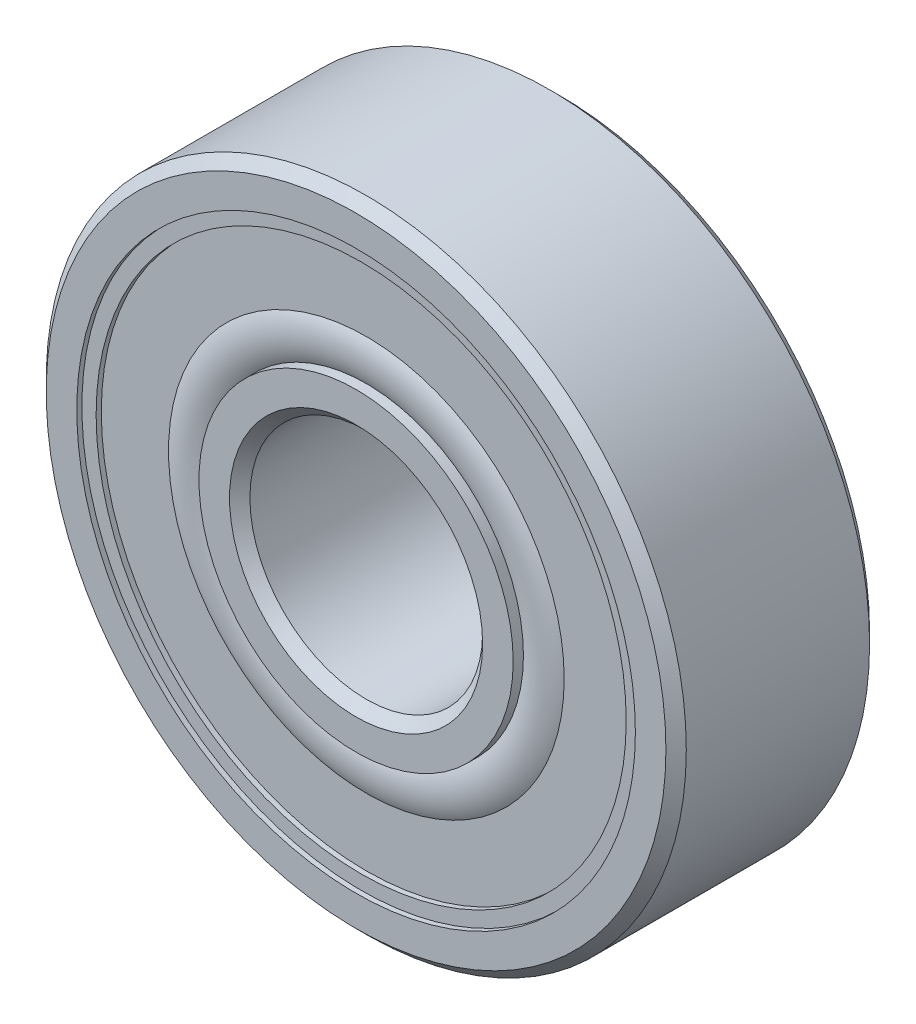
ISO-10303-21;
HEADER;
FILE_DESCRIPTION(('STEP AP214'),'2;1');
FILE_NAME('part.step','',(''),(''),'','','');
FILE_SCHEMA(('AUTOMOTIVE_DESIGN { 1 0 10303 214 1 1 1 1 }'));
ENDSEC;
DATA;
#1=APPLICATION_CONTEXT('core data for automotive mechanical design processes');
#2=APPLICATION_PROTOCOL_DEFINITION('international standard','automotive_design',2000,#1);
#3=PRODUCT_CONTEXT('',#1,'mechanical');
#4=PRODUCT('Part','Part','',(#3));
#5=PRODUCT_RELATED_PRODUCT_CATEGORY('part','',(#4));
#6=PRODUCT_DEFINITION_FORMATION('','',#4);
#7=PRODUCT_DEFINITION_CONTEXT('part definition',#1,'design');
#8=PRODUCT_DEFINITION('design','',#6,#7);
#9=PRODUCT_DEFINITION_SHAPE('','',#8);
#10=(LENGTH_UNIT() NAMED_UNIT(*) SI_UNIT(.MILLI.,.METRE.));
#11=(NAMED_UNIT(*) PLANE_ANGLE_UNIT() SI_UNIT($,.RADIAN.));
#12=(NAMED_UNIT(*) SI_UNIT($,.STERADIAN.) SOLID_ANGLE_UNIT());
#13=UNCERTAINTY_MEASURE_WITH_UNIT(LENGTH_MEASURE(1.E-05),#10,'distance_accuracy_value','');
#14=(GEOMETRIC_REPRESENTATION_CONTEXT(3) GLOBAL_UNCERTAINTY_ASSIGNED_CONTEXT((#13)) GLOBAL_UNIT_ASSIGNED_CONTEXT((#10,
#11,#12)) REPRESENTATION_CONTEXT('',''));
#15=CARTESIAN_POINT('',(0.,0.,0.));
#16=DIRECTION('',(0.,0.,1.));
#17=DIRECTION('',(1.,0.,0.));
#18=AXIS2_PLACEMENT_3D('',#15,#16,#17);
#19=CARTESIAN_POINT('',(0.,0.,-1.85890868663651));
#20=DIRECTION('',(0.,0.,1.));
#21=DIRECTION('',(1.,0.,0.));
#22=AXIS2_PLACEMENT_3D('',#19,#20,#21);
#23=TOROIDAL_SURFACE('',#22,6.10000000000001,1.46609131336349);
#24=CARTESIAN_POINT('',(0.,0.,-3.14709490730489));
#25=DIRECTION('',(0.,0.,1.));
#26=DIRECTION('',(1.,0.,0.));
#27=AXIS2_PLACEMENT_3D('',#24,#25,#26);
#28=CIRCLE('',#27,6.80000000000001);
#29=CARTESIAN_POINT('',(6.80000000000001,0.,-3.14709490730489));
#30=VERTEX_POINT('',#29);
#31=EDGE_CURVE('E11',#30,#30,#28,.T.);
#32=ORIENTED_EDGE('',*,*,#31,.F.);
#33=EDGE_LOOP('',(#32));
#34=FACE_BOUND('',#33,.T.);
#35=CARTESIAN_POINT('',(0.,0.,-3.14709490730489));
#36=DIRECTION('',(0.,0.,1.));
#37=DIRECTION('',(1.,0.,0.));
#38=AXIS2_PLACEMENT_3D('',#35,#36,#37);
#39=CIRCLE('',#38,5.40000000000001);
#40=CARTESIAN_POINT('',(5.40000000000001,0.,-3.14709490730489));
#41=VERTEX_POINT('',#40);
#42=EDGE_CURVE('E75',#41,#41,#39,.T.);
#43=ORIENTED_EDGE('',*,*,#42,.T.);
#44=EDGE_LOOP('',(#43));
#45=FACE_BOUND('',#44,.T.);
#46=ADVANCED_FACE('F50',(#34,#45),#23,.T.);
#47=CARTESIAN_POINT('',(0.,9.10999999999999,-3.14709490730489));
#48=DIRECTION('',(0.,0.,1.));
#49=DIRECTION('',(1.,0.,0.));
#50=AXIS2_PLACEMENT_3D('',#47,#48,#49);
#51=PLANE('',#50);
#52=CARTESIAN_POINT('',(0.,0.,-3.14709490730489));
#53=DIRECTION('',(0.,0.,1.));
#54=DIRECTION('',(1.,0.,0.));
#55=AXIS2_PLACEMENT_3D('',#52,#53,#54);
#56=CIRCLE('',#55,9.10999999999999);
#57=CARTESIAN_POINT('',(9.10999999999999,0.,-3.14709490730489));
#58=VERTEX_POINT('',#57);
#59=EDGE_CURVE('E56',#58,#58,#56,.T.);
#60=ORIENTED_EDGE('',*,*,#59,.F.);
#61=EDGE_LOOP('',(#60));
#62=FACE_BOUND('',#61,.T.);
#63=ORIENTED_EDGE('',*,*,#31,.T.);
#64=EDGE_LOOP('',(#63));
#65=FACE_BOUND('',#64,.T.);
#66=ADVANCED_FACE('F106',(#62,#65),#51,.F.);
#67=CARTESIAN_POINT('',(0.,0.,3.5));
#68=DIRECTION('',(0.,0.,1.));
#69=DIRECTION('',(1.,0.,0.));
#70=AXIS2_PLACEMENT_3D('',#67,#68,#69);
#71=CYLINDRICAL_SURFACE('',#70,9.10999999999999);
#72=CARTESIAN_POINT('',(0.,0.,-3.325));
#73=DIRECTION('',(0.,0.,1.));
#74=DIRECTION('',(1.,0.,0.));
#75=AXIS2_PLACEMENT_3D('',#72,#73,#74);
#76=CIRCLE('',#75,9.10999999999999);
#77=CARTESIAN_POINT('',(9.10999999999999,0.,-3.325));
#78=VERTEX_POINT('',#77);
#79=EDGE_CURVE('E60',#78,#78,#76,.T.);
#80=ORIENTED_EDGE('',*,*,#79,.F.);
#81=EDGE_LOOP('',(#80));
#82=FACE_BOUND('',#81,.T.);
#83=ORIENTED_EDGE('',*,*,#59,.T.);
#84=EDGE_LOOP('',(#83));
#85=FACE_BOUND('',#84,.T.);
#86=ADVANCED_FACE('F101',(#82,#85),#71,.F.);
#87=CARTESIAN_POINT('',(0.,9.59999999999999,-3.325));
#88=DIRECTION('',(0.,0.,1.));
#89=DIRECTION('',(1.,0.,0.));
#90=AXIS2_PLACEMENT_3D('',#87,#88,#89);
#91=PLANE('',#90);
#92=CARTESIAN_POINT('',(0.,0.,-3.325));
#93=DIRECTION('',(0.,0.,1.));
#94=DIRECTION('',(1.,0.,0.));
#95=AXIS2_PLACEMENT_3D('',#92,#93,#94);
#96=CIRCLE('',#95,9.59999999999999);
#97=CARTESIAN_POINT('',(9.59999999999999,0.,-3.325));
#98=VERTEX_POINT('',#97);
#99=EDGE_CURVE('E64',#98,#98,#96,.T.);
#100=ORIENTED_EDGE('',*,*,#99,.F.);
#101=EDGE_LOOP('',(#100));
#102=FACE_BOUND('',#101,.T.);
#103=ORIENTED_EDGE('',*,*,#79,.T.);
#104=EDGE_LOOP('',(#103));
#105=FACE_BOUND('',#104,.T.);
#106=ADVANCED_FACE('F95',(#102,#105),#91,.F.);
#107=CARTESIAN_POINT('',(0.,0.,3.5));
#108=DIRECTION('',(0.,0.,1.));
#109=DIRECTION('',(1.,0.,0.));
#110=AXIS2_PLACEMENT_3D('',#107,#108,#109);
#111=CYLINDRICAL_SURFACE('',#110,9.59999999999999);
#112=CARTESIAN_POINT('',(0.,0.,-2.61337962921956));
#113=DIRECTION('',(0.,0.,1.));
#114=DIRECTION('',(1.,0.,0.));
#115=AXIS2_PLACEMENT_3D('',#112,#113,#114);
#116=CIRCLE('',#115,9.59999999999999);
#117=CARTESIAN_POINT('',(9.59999999999999,0.,-2.61337962921956));
#118=VERTEX_POINT('',#117);
#119=EDGE_CURVE('E69',#118,#118,#116,.T.);
#120=ORIENTED_EDGE('',*,*,#119,.F.);
#121=EDGE_LOOP('',(#120));
#122=FACE_BOUND('',#121,.T.);
#123=ORIENTED_EDGE('',*,*,#99,.T.);
#124=EDGE_LOOP('',(#123));
#125=FACE_BOUND('',#124,.T.);
#126=ADVANCED_FACE('F89',(#122,#125),#111,.T.);
#127=CARTESIAN_POINT('',(0.,9.59999999999999,-2.61337962921956));
#128=DIRECTION('',(0.,0.,-1.));
#129=DIRECTION('',(-1.,0.,0.));
#130=AXIS2_PLACEMENT_3D('',#127,#128,#129);
#131=PLANE('',#130);
#132=CARTESIAN_POINT('',(0.,0.,-2.61337962921956));
#133=DIRECTION('',(0.,0.,1.));
#134=DIRECTION('',(1.,0.,0.));
#135=AXIS2_PLACEMENT_3D('',#132,#133,#134);
#136=CIRCLE('',#135,5.40000000000001);
#137=CARTESIAN_POINT('',(5.40000000000001,0.,-2.61337962921956));
#138=VERTEX_POINT('',#137);
#139=EDGE_CURVE('E72',#138,#138,#136,.T.);
#140=ORIENTED_EDGE('',*,*,#139,.F.);
#141=EDGE_LOOP('',(#140));
#142=FACE_BOUND('',#141,.T.);
#143=ORIENTED_EDGE('',*,*,#119,.T.);
#144=EDGE_LOOP('',(#143));
#145=FACE_BOUND('',#144,.T.);
#146=ADVANCED_FACE('F83',(#142,#145),#131,.F.);
#147=CARTESIAN_POINT('',(0.,0.,3.5));
#148=DIRECTION('',(0.,0.,1.));
#149=DIRECTION('',(1.,0.,0.));
#150=AXIS2_PLACEMENT_3D('',#147,#148,#149);
#151=CYLINDRICAL_SURFACE('',#150,5.40000000000001);
#152=ORIENTED_EDGE('',*,*,#42,.F.);
#153=EDGE_LOOP('',(#152));
#154=FACE_BOUND('',#153,.T.);
#155=ORIENTED_EDGE('',*,*,#139,.T.);
#156=EDGE_LOOP('',(#155));
#157=FACE_BOUND('',#156,.T.);
#158=ADVANCED_FACE('F80',(#154,#157),#151,.F.);
#159=CLOSED_SHELL('',(#46,#66,#86,#106,#126,#146,#158));
#160=MANIFOLD_SOLID_BREP('B2',#159);
#161=CARTESIAN_POINT('',(0.,9.59999999999999,3.325));
#162=DIRECTION('',(0.,0.,-1.));
#163=DIRECTION('',(-1.,0.,0.));
#164=AXIS2_PLACEMENT_3D('',#161,#162,#163);
#165=PLANE('',#164);
#166=CARTESIAN_POINT('',(0.,0.,3.325));
#167=DIRECTION('',(0.,0.,1.));
#168=DIRECTION('',(1.,0.,0.));
#169=AXIS2_PLACEMENT_3D('',#166,#167,#168);
#170=CIRCLE('',#169,9.10999999999999);
#171=CARTESIAN_POINT('',(9.10999999999999,0.,3.325));
#172=VERTEX_POINT('',#171);
#173=EDGE_CURVE('E174',#172,#172,#170,.T.);
#174=ORIENTED_EDGE('',*,*,#173,.F.);
#175=EDGE_LOOP('',(#174));
#176=FACE_BOUND('',#175,.T.);
#177=CARTESIAN_POINT('',(0.,0.,3.325));
#178=DIRECTION('',(0.,0.,1.));
#179=DIRECTION('',(1.,0.,0.));
#180=AXIS2_PLACEMENT_3D('',#177,#178,#179);
#181=CIRCLE('',#180,9.59999999999999);
#182=CARTESIAN_POINT('',(9.59999999999999,0.,3.325));
#183=VERTEX_POINT('',#182);
#184=EDGE_CURVE('E49',#183,#183,#181,.T.);
#185=ORIENTED_EDGE('',*,*,#184,.T.);
#186=EDGE_LOOP('',(#185));
#187=FACE_BOUND('',#186,.T.);
#188=ADVANCED_FACE('F149',(#176,#187),#165,.F.);
#189=CARTESIAN_POINT('',(0.,0.,3.5));
#190=DIRECTION('',(0.,0.,1.));
#191=DIRECTION('',(1.,0.,0.));
#192=AXIS2_PLACEMENT_3D('',#189,#190,#191);
#193=CYLINDRICAL_SURFACE('',#192,9.59999999999999);
#194=ORIENTED_EDGE('',*,*,#184,.F.);
#195=EDGE_LOOP('',(#194));
#196=FACE_BOUND('',#195,.T.);
#197=CARTESIAN_POINT('',(0.,0.,2.61337962921956));
#198=DIRECTION('',(0.,0.,1.));
#199=DIRECTION('',(1.,0.,0.));
#200=AXIS2_PLACEMENT_3D('',#197,#198,#199);
#201=CIRCLE('',#200,9.59999999999999);
#202=CARTESIAN_POINT('',(9.59999999999999,0.,2.61337962921956));
#203=VERTEX_POINT('',#202);
#204=EDGE_CURVE('E155',#203,#203,#201,.T.);
#205=ORIENTED_EDGE('',*,*,#204,.T.);
#206=EDGE_LOOP('',(#205));
#207=FACE_BOUND('',#206,.T.);
#208=ADVANCED_FACE('F181',(#196,#207),#193,.T.);
#209=CARTESIAN_POINT('',(0.,9.59999999999999,2.61337962921956));
#210=DIRECTION('',(0.,0.,1.));
#211=DIRECTION('',(1.,0.,0.));
#212=AXIS2_PLACEMENT_3D('',#209,#210,#211);
#213=PLANE('',#212);
#214=ORIENTED_EDGE('',*,*,#204,.F.);
#215=EDGE_LOOP('',(#214));
#216=FACE_BOUND('',#215,.T.);
#217=CARTESIAN_POINT('',(0.,0.,2.61337962921956));
#218=DIRECTION('',(0.,0.,1.));
#219=DIRECTION('',(1.,0.,0.));
#220=AXIS2_PLACEMENT_3D('',#217,#218,#219);
#221=CIRCLE('',#220,5.40000000000001);
#222=CARTESIAN_POINT('',(5.40000000000001,0.,2.61337962921956));
#223=VERTEX_POINT('',#222);
#224=EDGE_CURVE('E159',#223,#223,#221,.T.);
#225=ORIENTED_EDGE('',*,*,#224,.T.);
#226=EDGE_LOOP('',(#225));
#227=FACE_BOUND('',#226,.T.);
#228=ADVANCED_FACE('F185',(#216,#227),#213,.F.);
#229=CARTESIAN_POINT('',(0.,0.,3.5));
#230=DIRECTION('',(0.,0.,1.));
#231=DIRECTION('',(1.,0.,0.));
#232=AXIS2_PLACEMENT_3D('',#229,#230,#231);
#233=CYLINDRICAL_SURFACE('',#232,5.40000000000001);
#234=ORIENTED_EDGE('',*,*,#224,.F.);
#235=EDGE_LOOP('',(#234));
#236=FACE_BOUND('',#235,.T.);
#237=CARTESIAN_POINT('',(0.,0.,3.14709490730489));
#238=DIRECTION('',(0.,0.,1.));
#239=DIRECTION('',(1.,0.,0.));
#240=AXIS2_PLACEMENT_3D('',#237,#238,#239);
#241=CIRCLE('',#240,5.40000000000001);
#242=CARTESIAN_POINT('',(5.40000000000001,0.,3.14709490730489));
#243=VERTEX_POINT('',#242);
#244=EDGE_CURVE('E163',#243,#243,#241,.T.);
#245=ORIENTED_EDGE('',*,*,#244,.T.);
#246=EDGE_LOOP('',(#245));
#247=FACE_BOUND('',#246,.T.);
#248=ADVANCED_FACE('F190',(#236,#247),#233,.F.);
#249=CARTESIAN_POINT('',(0.,0.,1.85890868663651));
#250=DIRECTION('',(0.,0.,1.));
#251=DIRECTION('',(1.,0.,0.));
#252=AXIS2_PLACEMENT_3D('',#249,#250,#251);
#253=TOROIDAL_SURFACE('',#252,6.10000000000001,1.46609131336349);
#254=ORIENTED_EDGE('',*,*,#244,.F.);
#255=EDGE_LOOP('',(#254));
#256=FACE_BOUND('',#255,.T.);
#257=CARTESIAN_POINT('',(0.,0.,3.14709490730489));
#258=DIRECTION('',(0.,0.,1.));
#259=DIRECTION('',(1.,0.,0.));
#260=AXIS2_PLACEMENT_3D('',#257,#258,#259);
#261=CIRCLE('',#260,6.80000000000001);
#262=CARTESIAN_POINT('',(6.80000000000001,0.,3.14709490730489));
#263=VERTEX_POINT('',#262);
#264=EDGE_CURVE('E168',#263,#263,#261,.T.);
#265=ORIENTED_EDGE('',*,*,#264,.T.);
#266=EDGE_LOOP('',(#265));
#267=FACE_BOUND('',#266,.T.);
#268=ADVANCED_FACE('F196',(#256,#267),#253,.T.);
#269=CARTESIAN_POINT('',(0.,9.10999999999999,3.14709490730489));
#270=DIRECTION('',(0.,0.,-1.));
#271=DIRECTION('',(-1.,0.,0.));
#272=AXIS2_PLACEMENT_3D('',#269,#270,#271);
#273=PLANE('',#272);
#274=ORIENTED_EDGE('',*,*,#264,.F.);
#275=EDGE_LOOP('',(#274));
#276=FACE_BOUND('',#275,.T.);
#277=CARTESIAN_POINT('',(0.,0.,3.14709490730489));
#278=DIRECTION('',(0.,0.,1.));
#279=DIRECTION('',(1.,0.,0.));
#280=AXIS2_PLACEMENT_3D('',#277,#278,#279);
#281=CIRCLE('',#280,9.10999999999999);
#282=CARTESIAN_POINT('',(9.10999999999999,0.,3.14709490730489));
#283=VERTEX_POINT('',#282);
#284=EDGE_CURVE('E171',#283,#283,#281,.T.);
#285=ORIENTED_EDGE('',*,*,#284,.T.);
#286=EDGE_LOOP('',(#285));
#287=FACE_BOUND('',#286,.T.);
#288=ADVANCED_FACE('F200',(#276,#287),#273,.F.);
#289=CARTESIAN_POINT('',(0.,0.,3.5));
#290=DIRECTION('',(0.,0.,1.));
#291=DIRECTION('',(1.,0.,0.));
#292=AXIS2_PLACEMENT_3D('',#289,#290,#291);
#293=CYLINDRICAL_SURFACE('',#292,9.10999999999999);
#294=ORIENTED_EDGE('',*,*,#284,.F.);
#295=EDGE_LOOP('',(#294));
#296=FACE_BOUND('',#295,.T.);
#297=ORIENTED_EDGE('',*,*,#173,.T.);
#298=EDGE_LOOP('',(#297));
#299=FACE_BOUND('',#298,.T.);
#300=ADVANCED_FACE('F178',(#296,#299),#293,.F.);
#301=CLOSED_SHELL('',(#188,#208,#228,#248,#268,#288,#300));
#302=MANIFOLD_SOLID_BREP('B6',#301);
#303=CARTESIAN_POINT('',(-5.86373611851017,4.67617351394057,0.));
#304=DIRECTION('',(0.,0.,1.));
#305=DIRECTION('',(-0.781831482468022,0.623489801858743,0.));
#306=AXIS2_PLACEMENT_3D('',#303,#304,#305);
#307=SPHERICAL_SURFACE('',#306,2.61337962921956);
#308=CARTESIAN_POINT('',(-5.86373611851017,4.67617351394057,2.61337962921956));
#309=VERTEX_POINT('',#308);
#310=VERTEX_LOOP('',#309);
#311=FACE_BOUND('',#310,.T.);
#312=ADVANCED_FACE('F248',(#311),#307,.T.);
#313=CLOSED_SHELL('',(#312));
#314=MANIFOLD_SOLID_BREP('B44',#313);
#315=CARTESIAN_POINT('',(-7.31195934136369,-1.66890700467229,0.));
#316=DIRECTION('',(0.,0.,1.));
#317=DIRECTION('',(-0.974927912181826,-0.222520933956305,0.));
#318=AXIS2_PLACEMENT_3D('',#315,#316,#317);
#319=SPHERICAL_SURFACE('',#318,2.61337962921956);
#320=CARTESIAN_POINT('',(-7.31195934136369,-1.66890700467229,2.61337962921956));
#321=VERTEX_POINT('',#320);
#322=VERTEX_LOOP('',#321);
#323=FACE_BOUND('',#322,.T.);
#324=ADVANCED_FACE('F267',(#323),#319,.T.);
#325=CLOSED_SHELL('',(#324));
#326=MANIFOLD_SOLID_BREP('B145',#325);
#327=CARTESIAN_POINT('',(-3.25412804338174,-6.75726650926812,0.));
#328=DIRECTION('',(0.,0.,1.));
#329=DIRECTION('',(-0.433883739117565,-0.900968867902416,0.));
#330=AXIS2_PLACEMENT_3D('',#327,#328,#329);
#331=SPHERICAL_SURFACE('',#330,2.61337962921956);
#332=CARTESIAN_POINT('',(-3.25412804338174,-6.75726650926812,2.61337962921956));
#333=VERTEX_POINT('',#332);
#334=VERTEX_LOOP('',#333);
#335=FACE_BOUND('',#334,.T.);
#336=ADVANCED_FACE('F286',(#335),#331,.T.);
#337=CLOSED_SHELL('',(#336));
#338=MANIFOLD_SOLID_BREP('B244',#337);
#339=CARTESIAN_POINT('',(3.25412804338164,-6.75726650926816,0.));
#340=DIRECTION('',(0.,0.,1.));
#341=DIRECTION('',(0.433883739117553,-0.900968867902422,0.));
#342=AXIS2_PLACEMENT_3D('',#339,#340,#341);
#343=SPHERICAL_SURFACE('',#342,2.61337962921956);
#344=CARTESIAN_POINT('',(3.25412804338164,-6.75726650926816,2.61337962921956));
#345=VERTEX_POINT('',#344);
#346=VERTEX_LOOP('',#345);
#347=FACE_BOUND('',#346,.T.);
#348=ADVANCED_FACE('F305',(#347),#343,.T.);
#349=CLOSED_SHELL('',(#348));
#350=MANIFOLD_SOLID_BREP('B263',#349);
#351=CARTESIAN_POINT('',(7.31195934136367,-1.66890700467239,0.));
#352=DIRECTION('',(0.,0.,1.));
#353=DIRECTION('',(0.974927912181823,-0.222520933956318,0.));
#354=AXIS2_PLACEMENT_3D('',#351,#352,#353);
#355=SPHERICAL_SURFACE('',#354,2.61337962921956);
#356=CARTESIAN_POINT('',(7.31195934136367,-1.66890700467239,2.61337962921956));
#357=VERTEX_POINT('',#356);
#358=VERTEX_LOOP('',#357);
#359=FACE_BOUND('',#358,.T.);
#360=ADVANCED_FACE('F324',(#359),#355,.T.);
#361=CLOSED_SHELL('',(#360));
#362=MANIFOLD_SOLID_BREP('B282',#361);
#363=CARTESIAN_POINT('',(5.86373611851023,4.67617351394049,0.));
#364=DIRECTION('',(0.,0.,1.));
#365=DIRECTION('',(0.781831482468031,0.623489801858732,0.));
#366=AXIS2_PLACEMENT_3D('',#363,#364,#365);
#367=SPHERICAL_SURFACE('',#366,2.61337962921956);
#368=CARTESIAN_POINT('',(5.86373611851023,4.67617351394049,2.61337962921956));
#369=VERTEX_POINT('',#368);
#370=VERTEX_LOOP('',#369);
#371=FACE_BOUND('',#370,.T.);
#372=ADVANCED_FACE('F343',(#371),#367,.T.);
#373=CLOSED_SHELL('',(#372));
#374=MANIFOLD_SOLID_BREP('B301',#373);
#375=CARTESIAN_POINT('',(0.,7.5,0.));
#376=DIRECTION('',(0.,0.,1.));
#377=DIRECTION('',(0.,1.,0.));
#378=AXIS2_PLACEMENT_3D('',#375,#376,#377);
#379=SPHERICAL_SURFACE('',#378,2.61337962921956);
#380=CARTESIAN_POINT('',(0.,7.5,2.61337962921956));
#381=VERTEX_POINT('',#380);
#382=VERTEX_LOOP('',#381);
#383=FACE_BOUND('',#382,.T.);
#384=ADVANCED_FACE('F364',(#383),#379,.T.);
#385=CLOSED_SHELL('',(#384));
#386=MANIFOLD_SOLID_BREP('B320',#385);
#387=CARTESIAN_POINT('',(0.,0.,3.5));
#388=DIRECTION('',(0.,0.,1.));
#389=DIRECTION('',(1.,0.,0.));
#390=AXIS2_PLACEMENT_3D('',#387,#388,#389);
#391=CONICAL_SURFACE('',#390,4.35,0.785398163397449);
#392=CARTESIAN_POINT('',(0.,0.,3.15));
#393=DIRECTION('',(0.,0.,1.));
#394=DIRECTION('',(1.,0.,0.));
#395=AXIS2_PLACEMENT_3D('',#392,#393,#394);
#396=CIRCLE('',#395,4.);
#397=CARTESIAN_POINT('',(4.,0.,3.15));
#398=VERTEX_POINT('',#397);
#399=EDGE_CURVE('E363',#398,#398,#396,.T.);
#400=ORIENTED_EDGE('',*,*,#399,.F.);
#401=EDGE_LOOP('',(#400));
#402=FACE_BOUND('',#401,.T.);
#403=CARTESIAN_POINT('',(0.,0.,3.5));
#404=DIRECTION('',(0.,0.,1.));
#405=DIRECTION('',(1.,0.,0.));
#406=AXIS2_PLACEMENT_3D('',#403,#404,#405);
#407=CIRCLE('',#406,4.35);
#408=CARTESIAN_POINT('',(4.35,0.,3.5));
#409=VERTEX_POINT('',#408);
#410=EDGE_CURVE('E410',#409,#409,#407,.T.);
#411=ORIENTED_EDGE('',*,*,#410,.T.);
#412=EDGE_LOOP('',(#411));
#413=FACE_BOUND('',#412,.T.);
#414=ADVANCED_FACE('F382',(#402,#413),#391,.F.);
#415=CARTESIAN_POINT('',(0.,0.,3.5));
#416=DIRECTION('',(0.,0.,1.));
#417=DIRECTION('',(1.,0.,0.));
#418=AXIS2_PLACEMENT_3D('',#415,#416,#417);
#419=CYLINDRICAL_SURFACE('',#418,4.);
#420=CARTESIAN_POINT('',(0.,0.,-3.15));
#421=DIRECTION('',(0.,0.,1.));
#422=DIRECTION('',(1.,0.,0.));
#423=AXIS2_PLACEMENT_3D('',#420,#421,#422);
#424=CIRCLE('',#423,4.);
#425=CARTESIAN_POINT('',(4.,0.,-3.15));
#426=VERTEX_POINT('',#425);
#427=EDGE_CURVE('E388',#426,#426,#424,.T.);
#428=ORIENTED_EDGE('',*,*,#427,.F.);
#429=EDGE_LOOP('',(#428));
#430=FACE_BOUND('',#429,.T.);
#431=ORIENTED_EDGE('',*,*,#399,.T.);
#432=EDGE_LOOP('',(#431));
#433=FACE_BOUND('',#432,.T.);
#434=ADVANCED_FACE('F447',(#430,#433),#419,.F.);
#435=CARTESIAN_POINT('',(0.,0.,-3.15));
#436=DIRECTION('',(0.,0.,-1.));
#437=DIRECTION('',(-1.,0.,0.));
#438=AXIS2_PLACEMENT_3D('',#435,#436,#437);
#439=CONICAL_SURFACE('',#438,4.,0.785398163397447);
#440=CARTESIAN_POINT('',(0.,0.,-3.5));
#441=DIRECTION('',(0.,0.,1.));
#442=DIRECTION('',(1.,0.,0.));
#443=AXIS2_PLACEMENT_3D('',#440,#441,#442);
#444=CIRCLE('',#443,4.35);
#445=CARTESIAN_POINT('',(4.35,0.,-3.5));
#446=VERTEX_POINT('',#445);
#447=EDGE_CURVE('E392',#446,#446,#444,.T.);
#448=ORIENTED_EDGE('',*,*,#447,.F.);
#449=EDGE_LOOP('',(#448));
#450=FACE_BOUND('',#449,.T.);
#451=ORIENTED_EDGE('',*,*,#427,.T.);
#452=EDGE_LOOP('',(#451));
#453=FACE_BOUND('',#452,.T.);
#454=ADVANCED_FACE('F442',(#450,#453),#439,.F.);
#455=CARTESIAN_POINT('',(0.,4.35,-3.5));
#456=DIRECTION('',(0.,0.,1.));
#457=DIRECTION('',(1.,0.,0.));
#458=AXIS2_PLACEMENT_3D('',#455,#456,#457);
#459=PLANE('',#458);
#460=CARTESIAN_POINT('',(0.,0.,-3.5));
#461=DIRECTION('',(0.,0.,1.));
#462=DIRECTION('',(1.,0.,0.));
#463=AXIS2_PLACEMENT_3D('',#460,#461,#462);
#464=CIRCLE('',#463,5.40000000000001);
#465=CARTESIAN_POINT('',(5.40000000000001,0.,-3.5));
#466=VERTEX_POINT('',#465);
#467=EDGE_CURVE('E396',#466,#466,#464,.T.);
#468=ORIENTED_EDGE('',*,*,#467,.F.);
#469=EDGE_LOOP('',(#468));
#470=FACE_BOUND('',#469,.T.);
#471=ORIENTED_EDGE('',*,*,#447,.T.);
#472=EDGE_LOOP('',(#471));
#473=FACE_BOUND('',#472,.T.);
#474=ADVANCED_FACE('F436',(#470,#473),#459,.F.);
#475=CARTESIAN_POINT('',(0.,0.,3.5));
#476=DIRECTION('',(0.,0.,1.));
#477=DIRECTION('',(1.,0.,0.));
#478=AXIS2_PLACEMENT_3D('',#475,#476,#477);
#479=CYLINDRICAL_SURFACE('',#478,5.4);
#480=CARTESIAN_POINT('',(0.,0.,-1.55555555555556));
#481=DIRECTION('',(0.,0.,1.));
#482=DIRECTION('',(1.,0.,0.));
#483=AXIS2_PLACEMENT_3D('',#480,#481,#482);
#484=CIRCLE('',#483,5.4);
#485=CARTESIAN_POINT('',(5.4,0.,-1.55555555555556));
#486=VERTEX_POINT('',#485);
#487=EDGE_CURVE('E401',#486,#486,#484,.T.);
#488=ORIENTED_EDGE('',*,*,#487,.F.);
#489=EDGE_LOOP('',(#488));
#490=FACE_BOUND('',#489,.T.);
#491=ORIENTED_EDGE('',*,*,#467,.T.);
#492=EDGE_LOOP('',(#491));
#493=FACE_BOUND('',#492,.T.);
#494=ADVANCED_FACE('F430',(#490,#493),#479,.T.);
#495=CARTESIAN_POINT('',(0.,0.,0.));
#496=DIRECTION('',(0.,0.,1.));
#497=DIRECTION('',(1.,0.,0.));
#498=AXIS2_PLACEMENT_3D('',#495,#496,#497);
#499=TOROIDAL_SURFACE('',#498,7.5,2.61337962921956);
#500=CARTESIAN_POINT('',(0.,0.,1.55555555555556));
#501=DIRECTION('',(0.,0.,1.));
#502=DIRECTION('',(1.,0.,0.));
#503=AXIS2_PLACEMENT_3D('',#500,#501,#502);
#504=CIRCLE('',#503,5.4);
#505=CARTESIAN_POINT('',(5.4,0.,1.55555555555556));
#506=VERTEX_POINT('',#505);
#507=EDGE_CURVE('E404',#506,#506,#504,.T.);
#508=ORIENTED_EDGE('',*,*,#507,.F.);
#509=EDGE_LOOP('',(#508));
#510=FACE_BOUND('',#509,.T.);
#511=ORIENTED_EDGE('',*,*,#487,.T.);
#512=EDGE_LOOP('',(#511));
#513=FACE_BOUND('',#512,.T.);
#514=ADVANCED_FACE('F424',(#510,#513),#499,.F.);
#515=CARTESIAN_POINT('',(0.,0.,3.5));
#516=DIRECTION('',(0.,0.,1.));
#517=DIRECTION('',(1.,0.,0.));
#518=AXIS2_PLACEMENT_3D('',#515,#516,#517);
#519=CYLINDRICAL_SURFACE('',#518,5.4);
#520=CARTESIAN_POINT('',(0.,0.,3.5));
#521=DIRECTION('',(0.,0.,1.));
#522=DIRECTION('',(1.,0.,0.));
#523=AXIS2_PLACEMENT_3D('',#520,#521,#522);
#524=CIRCLE('',#523,5.40000000000001);
#525=CARTESIAN_POINT('',(5.40000000000001,0.,3.5));
#526=VERTEX_POINT('',#525);
#527=EDGE_CURVE('E407',#526,#526,#524,.T.);
#528=ORIENTED_EDGE('',*,*,#527,.F.);
#529=EDGE_LOOP('',(#528));
#530=FACE_BOUND('',#529,.T.);
#531=ORIENTED_EDGE('',*,*,#507,.T.);
#532=EDGE_LOOP('',(#531));
#533=FACE_BOUND('',#532,.T.);
#534=ADVANCED_FACE('F418',(#530,#533),#519,.T.);
#535=CARTESIAN_POINT('',(0.,4.35,3.5));
#536=DIRECTION('',(0.,0.,-1.));
#537=DIRECTION('',(-1.,0.,0.));
#538=AXIS2_PLACEMENT_3D('',#535,#536,#537);
#539=PLANE('',#538);
#540=ORIENTED_EDGE('',*,*,#410,.F.);
#541=EDGE_LOOP('',(#540));
#542=FACE_BOUND('',#541,.T.);
#543=ORIENTED_EDGE('',*,*,#527,.T.);
#544=EDGE_LOOP('',(#543));
#545=FACE_BOUND('',#544,.T.);
#546=ADVANCED_FACE('F415',(#542,#545),#539,.F.);
#547=CLOSED_SHELL('',(#414,#434,#454,#474,#494,#514,#534,#546));
#548=MANIFOLD_SOLID_BREP('B339',#547);
#549=CARTESIAN_POINT('',(0.,0.,3.15));
#550=DIRECTION('',(0.,0.,-1.));
#551=DIRECTION('',(-1.,0.,0.));
#552=AXIS2_PLACEMENT_3D('',#549,#550,#551);
#553=CONICAL_SURFACE('',#552,11.,0.785398163397447);
#554=CARTESIAN_POINT('',(0.,0.,3.5));
#555=DIRECTION('',(0.,0.,1.));
#556=DIRECTION('',(1.,0.,0.));
#557=AXIS2_PLACEMENT_3D('',#554,#555,#556);
#558=CIRCLE('',#557,10.65);
#559=CARTESIAN_POINT('',(10.65,0.,3.5));
#560=VERTEX_POINT('',#559);
#561=EDGE_CURVE('E381',#560,#560,#558,.T.);
#562=ORIENTED_EDGE('',*,*,#561,.F.);
#563=EDGE_LOOP('',(#562));
#564=FACE_BOUND('',#563,.T.);
#565=CARTESIAN_POINT('',(0.,0.,3.15));
#566=DIRECTION('',(0.,0.,1.));
#567=DIRECTION('',(1.,0.,0.));
#568=AXIS2_PLACEMENT_3D('',#565,#566,#567);
#569=CIRCLE('',#568,11.);
#570=CARTESIAN_POINT('',(11.,0.,3.15));
#571=VERTEX_POINT('',#570);
#572=EDGE_CURVE('E516',#571,#571,#569,.T.);
#573=ORIENTED_EDGE('',*,*,#572,.T.);
#574=EDGE_LOOP('',(#573));
#575=FACE_BOUND('',#574,.T.);
#576=ADVANCED_FACE('F488',(#564,#575),#553,.T.);
#577=CARTESIAN_POINT('',(0.,10.65,3.5));
#578=DIRECTION('',(0.,0.,-1.));
#579=DIRECTION('',(-1.,0.,0.));
#580=AXIS2_PLACEMENT_3D('',#577,#578,#579);
#581=PLANE('',#580);
#582=CARTESIAN_POINT('',(0.,0.,3.5));
#583=DIRECTION('',(0.,0.,1.));
#584=DIRECTION('',(1.,0.,0.));
#585=AXIS2_PLACEMENT_3D('',#582,#583,#584);
#586=CIRCLE('',#585,9.59999999999999);
#587=CARTESIAN_POINT('',(9.59999999999999,0.,3.5));
#588=VERTEX_POINT('',#587);
#589=EDGE_CURVE('E494',#588,#588,#586,.T.);
#590=ORIENTED_EDGE('',*,*,#589,.F.);
#591=EDGE_LOOP('',(#590));
#592=FACE_BOUND('',#591,.T.);
#593=ORIENTED_EDGE('',*,*,#561,.T.);
#594=EDGE_LOOP('',(#593));
#595=FACE_BOUND('',#594,.T.);
#596=ADVANCED_FACE('F553',(#592,#595),#581,.F.);
#597=CARTESIAN_POINT('',(0.,0.,3.5));
#598=DIRECTION('',(0.,0.,1.));
#599=DIRECTION('',(1.,0.,0.));
#600=AXIS2_PLACEMENT_3D('',#597,#598,#599);
#601=CYLINDRICAL_SURFACE('',#600,9.6);
#602=CARTESIAN_POINT('',(0.,0.,1.55555555555556));
#603=DIRECTION('',(0.,0.,1.));
#604=DIRECTION('',(1.,0.,0.));
#605=AXIS2_PLACEMENT_3D('',#602,#603,#604);
#606=CIRCLE('',#605,9.6);
#607=CARTESIAN_POINT('',(9.6,0.,1.55555555555556));
#608=VERTEX_POINT('',#607);
#609=EDGE_CURVE('E498',#608,#608,#606,.T.);
#610=ORIENTED_EDGE('',*,*,#609,.F.);
#611=EDGE_LOOP('',(#610));
#612=FACE_BOUND('',#611,.T.);
#613=ORIENTED_EDGE('',*,*,#589,.T.);
#614=EDGE_LOOP('',(#613));
#615=FACE_BOUND('',#614,.T.);
#616=ADVANCED_FACE('F548',(#612,#615),#601,.F.);
#617=CARTESIAN_POINT('',(0.,0.,0.));
#618=DIRECTION('',(0.,0.,1.));
#619=DIRECTION('',(1.,0.,0.));
#620=AXIS2_PLACEMENT_3D('',#617,#618,#619);
#621=TOROIDAL_SURFACE('',#620,7.5,2.61337962921956);
#622=CARTESIAN_POINT('',(0.,0.,-1.55555555555556));
#623=DIRECTION('',(0.,0.,1.));
#624=DIRECTION('',(1.,0.,0.));
#625=AXIS2_PLACEMENT_3D('',#622,#623,#624);
#626=CIRCLE('',#625,9.6);
#627=CARTESIAN_POINT('',(9.6,0.,-1.55555555555556));
#628=VERTEX_POINT('',#627);
#629=EDGE_CURVE('E502',#628,#628,#626,.T.);
#630=ORIENTED_EDGE('',*,*,#629,.F.);
#631=EDGE_LOOP('',(#630));
#632=FACE_BOUND('',#631,.T.);
#633=ORIENTED_EDGE('',*,*,#609,.T.);
#634=EDGE_LOOP('',(#633));
#635=FACE_BOUND('',#634,.T.);
#636=ADVANCED_FACE('F542',(#632,#635),#621,.F.);
#637=CARTESIAN_POINT('',(0.,0.,3.5));
#638=DIRECTION('',(0.,0.,1.));
#639=DIRECTION('',(1.,0.,0.));
#640=AXIS2_PLACEMENT_3D('',#637,#638,#639);
#641=CYLINDRICAL_SURFACE('',#640,9.6);
#642=CARTESIAN_POINT('',(0.,0.,-3.5));
#643=DIRECTION('',(0.,0.,1.));
#644=DIRECTION('',(1.,0.,0.));
#645=AXIS2_PLACEMENT_3D('',#642,#643,#644);
#646=CIRCLE('',#645,9.59999999999999);
#647=CARTESIAN_POINT('',(9.59999999999999,0.,-3.5));
#648=VERTEX_POINT('',#647);
#649=EDGE_CURVE('E507',#648,#648,#646,.T.);
#650=ORIENTED_EDGE('',*,*,#649,.F.);
#651=EDGE_LOOP('',(#650));
#652=FACE_BOUND('',#651,.T.);
#653=ORIENTED_EDGE('',*,*,#629,.T.);
#654=EDGE_LOOP('',(#653));
#655=FACE_BOUND('',#654,.T.);
#656=ADVANCED_FACE('F536',(#652,#655),#641,.F.);
#657=CARTESIAN_POINT('',(0.,10.65,-3.5));
#658=DIRECTION('',(0.,0.,1.));
#659=DIRECTION('',(1.,0.,0.));
#660=AXIS2_PLACEMENT_3D('',#657,#658,#659);
#661=PLANE('',#660);
#662=CARTESIAN_POINT('',(0.,0.,-3.5));
#663=DIRECTION('',(0.,0.,1.));
#664=DIRECTION('',(1.,0.,0.));
#665=AXIS2_PLACEMENT_3D('',#662,#663,#664);
#666=CIRCLE('',#665,10.65);
#667=CARTESIAN_POINT('',(10.65,0.,-3.5));
#668=VERTEX_POINT('',#667);
#669=EDGE_CURVE('E510',#668,#668,#666,.T.);
#670=ORIENTED_EDGE('',*,*,#669,.F.);
#671=EDGE_LOOP('',(#670));
#672=FACE_BOUND('',#671,.T.);
#673=ORIENTED_EDGE('',*,*,#649,.T.);
#674=EDGE_LOOP('',(#673));
#675=FACE_BOUND('',#674,.T.);
#676=ADVANCED_FACE('F530',(#672,#675),#661,.F.);
#677=CARTESIAN_POINT('',(0.,0.,-3.5));
#678=DIRECTION('',(0.,0.,1.));
#679=DIRECTION('',(1.,0.,0.));
#680=AXIS2_PLACEMENT_3D('',#677,#678,#679);
#681=CONICAL_SURFACE('',#680,10.65,0.785398163397442);
#682=CARTESIAN_POINT('',(0.,0.,-3.15));
#683=DIRECTION('',(0.,0.,1.));
#684=DIRECTION('',(1.,0.,0.));
#685=AXIS2_PLACEMENT_3D('',#682,#683,#684);
#686=CIRCLE('',#685,11.);
#687=CARTESIAN_POINT('',(11.,0.,-3.15));
#688=VERTEX_POINT('',#687);
#689=EDGE_CURVE('E513',#688,#688,#686,.T.);
#690=ORIENTED_EDGE('',*,*,#689,.F.);
#691=EDGE_LOOP('',(#690));
#692=FACE_BOUND('',#691,.T.);
#693=ORIENTED_EDGE('',*,*,#669,.T.);
#694=EDGE_LOOP('',(#693));
#695=FACE_BOUND('',#694,.T.);
#696=ADVANCED_FACE('F524',(#692,#695),#681,.T.);
#697=CARTESIAN_POINT('',(0.,0.,3.5));
#698=DIRECTION('',(0.,0.,1.));
#699=DIRECTION('',(1.,0.,0.));
#700=AXIS2_PLACEMENT_3D('',#697,#698,#699);
#701=CYLINDRICAL_SURFACE('',#700,11.);
#702=ORIENTED_EDGE('',*,*,#572,.F.);
#703=EDGE_LOOP('',(#702));
#704=FACE_BOUND('',#703,.T.);
#705=ORIENTED_EDGE('',*,*,#689,.T.);
#706=EDGE_LOOP('',(#705));
#707=FACE_BOUND('',#706,.T.);
#708=ADVANCED_FACE('F521',(#704,#707),#701,.T.);
#709=CLOSED_SHELL('',(#576,#596,#616,#636,#656,#676,#696,#708));
#710=MANIFOLD_SOLID_BREP('B358',#709);
#711=ADVANCED_BREP_SHAPE_REPRESENTATION('',(#18,#160,#302,#314,#326,#338,#350,#362,#374,#386,
#548,#710),#14);
#712=SHAPE_DEFINITION_REPRESENTATION(#9,#711);
ENDSEC;
END-ISO-10303-21;
